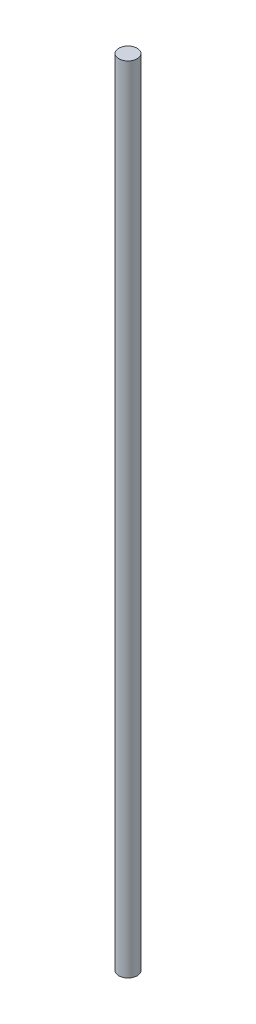
ISO-10303-21;
HEADER;
FILE_DESCRIPTION(('STEP AP214'),'2;1');
FILE_NAME('part.step','',(''),(''),'','','');
FILE_SCHEMA(('AUTOMOTIVE_DESIGN { 1 0 10303 214 1 1 1 1 }'));
ENDSEC;
DATA;
#1=APPLICATION_CONTEXT('core data for automotive mechanical design processes');
#2=APPLICATION_PROTOCOL_DEFINITION('international standard','automotive_design',2000,#1);
#3=PRODUCT_CONTEXT('',#1,'mechanical');
#4=PRODUCT('Part','Part','',(#3));
#5=PRODUCT_RELATED_PRODUCT_CATEGORY('part','',(#4));
#6=PRODUCT_DEFINITION_FORMATION('','',#4);
#7=PRODUCT_DEFINITION_CONTEXT('part definition',#1,'design');
#8=PRODUCT_DEFINITION('design','',#6,#7);
#9=PRODUCT_DEFINITION_SHAPE('','',#8);
#10=(LENGTH_UNIT() NAMED_UNIT(*) SI_UNIT(.MILLI.,.METRE.));
#11=(NAMED_UNIT(*) PLANE_ANGLE_UNIT() SI_UNIT($,.RADIAN.));
#12=(NAMED_UNIT(*) SI_UNIT($,.STERADIAN.) SOLID_ANGLE_UNIT());
#13=UNCERTAINTY_MEASURE_WITH_UNIT(LENGTH_MEASURE(1.E-05),#10,'distance_accuracy_value','');
#14=(GEOMETRIC_REPRESENTATION_CONTEXT(3) GLOBAL_UNCERTAINTY_ASSIGNED_CONTEXT((#13)) GLOBAL_UNIT_ASSIGNED_CONTEXT((#10,
#11,#12)) REPRESENTATION_CONTEXT('',''));
#15=CARTESIAN_POINT('',(0.,0.,0.));
#16=DIRECTION('',(0.,0.,1.));
#17=DIRECTION('',(1.,0.,0.));
#18=AXIS2_PLACEMENT_3D('',#15,#16,#17);
#19=CARTESIAN_POINT('',(0.,130.,0.));
#20=DIRECTION('',(0.,-1.,0.));
#21=DIRECTION('',(0.,0.,-1.));
#22=AXIS2_PLACEMENT_3D('',#19,#20,#21);
#23=CYLINDRICAL_SURFACE('',#22,1.5);
#24=CARTESIAN_POINT('',(0.,130.,0.));
#25=DIRECTION('',(0.,1.,0.));
#26=DIRECTION('',(0.,0.,1.));
#27=AXIS2_PLACEMENT_3D('',#24,#25,#26);
#28=CIRCLE('',#27,1.5);
#29=CARTESIAN_POINT('',(0.,130.,1.5));
#30=VERTEX_POINT('',#29);
#31=EDGE_CURVE('E10',#30,#30,#28,.T.);
#32=ORIENTED_EDGE('',*,*,#31,.F.);
#33=EDGE_LOOP('',(#32));
#34=FACE_BOUND('',#33,.T.);
#35=CARTESIAN_POINT('',(0.,0.,0.));
#36=DIRECTION('',(0.,1.,0.));
#37=DIRECTION('',(0.,0.,1.));
#38=AXIS2_PLACEMENT_3D('',#35,#36,#37);
#39=CIRCLE('',#38,1.5);
#40=CARTESIAN_POINT('',(0.,0.,1.5));
#41=VERTEX_POINT('',#40);
#42=EDGE_CURVE('E34',#41,#41,#39,.T.);
#43=ORIENTED_EDGE('',*,*,#42,.T.);
#44=EDGE_LOOP('',(#43));
#45=FACE_BOUND('',#44,.T.);
#46=ADVANCED_FACE('F31',(#34,#45),#23,.T.);
#47=CARTESIAN_POINT('',(0.,130.,0.));
#48=DIRECTION('',(0.,1.,0.));
#49=DIRECTION('',(0.,0.,1.));
#50=AXIS2_PLACEMENT_3D('',#47,#48,#49);
#51=PLANE('',#50);
#52=ORIENTED_EDGE('',*,*,#31,.T.);
#53=EDGE_LOOP('',(#52));
#54=FACE_BOUND('',#53,.T.);
#55=ADVANCED_FACE('F46',(#54),#51,.T.);
#56=CARTESIAN_POINT('',(0.,0.,0.));
#57=DIRECTION('',(0.,1.,0.));
#58=DIRECTION('',(0.,0.,1.));
#59=AXIS2_PLACEMENT_3D('',#56,#57,#58);
#60=PLANE('',#59);
#61=ORIENTED_EDGE('',*,*,#42,.F.);
#62=EDGE_LOOP('',(#61));
#63=FACE_BOUND('',#62,.T.);
#64=ADVANCED_FACE('F44',(#63),#60,.F.);
#65=CLOSED_SHELL('',(#46,#55,#64));
#66=MANIFOLD_SOLID_BREP('B2',#65);
#67=ADVANCED_BREP_SHAPE_REPRESENTATION('',(#18,#66),#14);
#68=SHAPE_DEFINITION_REPRESENTATION(#9,#67);
ENDSEC;
END-ISO-10303-21;
